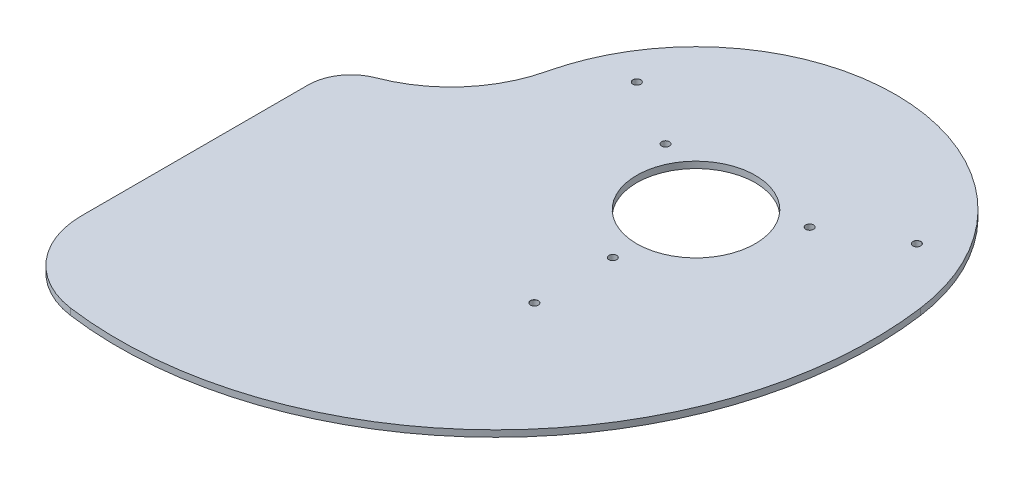
ISO-10303-21;
HEADER;
FILE_DESCRIPTION(('STEP AP214'),'2;1');
FILE_NAME('part.step','',(''),(''),'','','');
FILE_SCHEMA(('AUTOMOTIVE_DESIGN { 1 0 10303 214 1 1 1 1 }'));
ENDSEC;
DATA;
#1=APPLICATION_CONTEXT('core data for automotive mechanical design processes');
#2=APPLICATION_PROTOCOL_DEFINITION('international standard','automotive_design',2000,#1);
#3=PRODUCT_CONTEXT('',#1,'mechanical');
#4=PRODUCT('Part','Part','',(#3));
#5=PRODUCT_RELATED_PRODUCT_CATEGORY('part','',(#4));
#6=PRODUCT_DEFINITION_FORMATION('','',#4);
#7=PRODUCT_DEFINITION_CONTEXT('part definition',#1,'design');
#8=PRODUCT_DEFINITION('design','',#6,#7);
#9=PRODUCT_DEFINITION_SHAPE('','',#8);
#10=(LENGTH_UNIT() NAMED_UNIT(*) SI_UNIT(.MILLI.,.METRE.));
#11=(NAMED_UNIT(*) PLANE_ANGLE_UNIT() SI_UNIT($,.RADIAN.));
#12=(NAMED_UNIT(*) SI_UNIT($,.STERADIAN.) SOLID_ANGLE_UNIT());
#13=UNCERTAINTY_MEASURE_WITH_UNIT(LENGTH_MEASURE(1.E-05),#10,'distance_accuracy_value','');
#14=(GEOMETRIC_REPRESENTATION_CONTEXT(3) GLOBAL_UNCERTAINTY_ASSIGNED_CONTEXT((#13)) GLOBAL_UNIT_ASSIGNED_CONTEXT((#10,
#11,#12)) REPRESENTATION_CONTEXT('',''));
#15=CARTESIAN_POINT('',(0.,0.,0.));
#16=DIRECTION('',(0.,0.,1.));
#17=DIRECTION('',(1.,0.,0.));
#18=AXIS2_PLACEMENT_3D('',#15,#16,#17);
#19=CARTESIAN_POINT('',(0.,35.,0.));
#20=DIRECTION('',(0.,-1.,0.));
#21=DIRECTION('',(0.,0.,-1.));
#22=AXIS2_PLACEMENT_3D('',#19,#20,#21);
#23=PLANE('',#22);
#24=CARTESIAN_POINT('',(-64.9519052838329,35.,-37.5));
#25=DIRECTION('',(0.,1.,0.));
#26=DIRECTION('',(0.,0.,1.));
#27=AXIS2_PLACEMENT_3D('',#24,#25,#26);
#28=CIRCLE('',#27,1.82500000000001);
#29=CARTESIAN_POINT('',(-64.9519052838329,35.,-35.675));
#30=VERTEX_POINT('',#29);
#31=EDGE_CURVE('E405',#30,#30,#28,.T.);
#32=ORIENTED_EDGE('',*,*,#31,.F.);
#33=EDGE_LOOP('',(#32));
#34=FACE_BOUND('',#33,.T.);
#35=CARTESIAN_POINT('',(64.9519052838329,35.,-37.5));
#36=DIRECTION('',(0.,1.,0.));
#37=DIRECTION('',(0.,0.,1.));
#38=AXIS2_PLACEMENT_3D('',#35,#36,#37);
#39=CIRCLE('',#38,1.82500000000001);
#40=CARTESIAN_POINT('',(64.9519052838329,35.,-35.675));
#41=VERTEX_POINT('',#40);
#42=EDGE_CURVE('E421',#41,#41,#39,.T.);
#43=ORIENTED_EDGE('',*,*,#42,.F.);
#44=EDGE_LOOP('',(#43));
#45=FACE_BOUND('',#44,.T.);
#46=CARTESIAN_POINT('',(0.,35.,0.));
#47=DIRECTION('',(0.,1.,0.));
#48=DIRECTION('',(0.,0.,1.));
#49=AXIS2_PLACEMENT_3D('',#46,#47,#48);
#50=CIRCLE('',#49,27.5);
#51=CARTESIAN_POINT('',(0.,35.,27.5));
#52=VERTEX_POINT('',#51);
#53=EDGE_CURVE('E163',#52,#52,#50,.T.);
#54=ORIENTED_EDGE('',*,*,#53,.F.);
#55=EDGE_LOOP('',(#54));
#56=FACE_BOUND('',#55,.T.);
#57=CARTESIAN_POINT('',(0.,35.,38.600000000005));
#58=DIRECTION('',(0.,-1.,0.));
#59=DIRECTION('',(0.,0.,-1.));
#60=AXIS2_PLACEMENT_3D('',#57,#58,#59);
#61=CIRCLE('',#60,1.8);
#62=CARTESIAN_POINT('',(0.,35.,36.800000000005));
#63=VERTEX_POINT('',#62);
#64=EDGE_CURVE('E160',#63,#63,#61,.T.);
#65=ORIENTED_EDGE('',*,*,#64,.T.);
#66=EDGE_LOOP('',(#65));
#67=FACE_BOUND('',#66,.T.);
#68=CARTESIAN_POINT('',(-33.4285805860836,35.,-19.3000000000027));
#69=DIRECTION('',(0.,-1.,0.));
#70=DIRECTION('',(0.,0.,-1.));
#71=AXIS2_PLACEMENT_3D('',#68,#69,#70);
#72=CIRCLE('',#71,1.8);
#73=CARTESIAN_POINT('',(-33.4285805860836,35.,-21.1000000000027));
#74=VERTEX_POINT('',#73);
#75=EDGE_CURVE('E154',#74,#74,#72,.T.);
#76=ORIENTED_EDGE('',*,*,#75,.T.);
#77=EDGE_LOOP('',(#76));
#78=FACE_BOUND('',#77,.T.);
#79=CARTESIAN_POINT('',(33.4285805860838,35.,-19.3000000000022));
#80=DIRECTION('',(0.,-1.,0.));
#81=DIRECTION('',(0.,0.,-1.));
#82=AXIS2_PLACEMENT_3D('',#79,#80,#81);
#83=CIRCLE('',#82,1.8);
#84=CARTESIAN_POINT('',(33.4285805860838,35.,-21.1000000000022));
#85=VERTEX_POINT('',#84);
#86=EDGE_CURVE('E148',#85,#85,#83,.T.);
#87=ORIENTED_EDGE('',*,*,#86,.T.);
#88=EDGE_LOOP('',(#87));
#89=FACE_BOUND('',#88,.T.);
#90=CARTESIAN_POINT('',(-120.,35.,40.));
#91=DIRECTION('',(0.,1.,0.));
#92=DIRECTION('',(0.,0.,1.));
#93=AXIS2_PLACEMENT_3D('',#90,#91,#92);
#94=CIRCLE('',#93,20.);
#95=CARTESIAN_POINT('',(-140.,35.,40.));
#96=VERTEX_POINT('',#95);
#97=CARTESIAN_POINT('',(-127.121626837055,35.,21.3109007388336));
#98=VERTEX_POINT('',#97);
#99=EDGE_CURVE('E101',#96,#98,#94,.F.);
#100=ORIENTED_EDGE('',*,*,#99,.F.);
#101=DIRECTION('',(0.,0.,1.));
#102=VECTOR('',#101,1.);
#103=CARTESIAN_POINT('',(-140.,35.,0.));
#104=LINE('',#103,#102);
#105=CARTESIAN_POINT('',(-140.,35.,145.));
#106=VERTEX_POINT('',#105);
#107=EDGE_CURVE('E132',#96,#106,#104,.T.);
#108=ORIENTED_EDGE('',*,*,#107,.T.);
#109=CARTESIAN_POINT('',(-100.,35.,145.));
#110=DIRECTION('',(0.,1.,0.));
#111=DIRECTION('',(0.,0.,1.));
#112=AXIS2_PLACEMENT_3D('',#109,#110,#111);
#113=CIRCLE('',#112,40.);
#114=CARTESIAN_POINT('',(-105.413194934563,35.,184.632023927632));
#115=VERTEX_POINT('',#114);
#116=EDGE_CURVE('E62',#106,#115,#113,.T.);
#117=ORIENTED_EDGE('',*,*,#116,.T.);
#118=CARTESIAN_POINT('',(-81.7304670958509,35.,11.2419192442408));
#119=DIRECTION('',(0.,1.,0.));
#120=DIRECTION('',(0.,0.,1.));
#121=AXIS2_PLACEMENT_3D('',#118,#119,#120);
#122=CIRCLE('',#121,175.);
#123=CARTESIAN_POINT('',(91.6371903801965,35.,-12.6045761223306));
#124=VERTEX_POINT('',#123);
#125=EDGE_CURVE('E125',#115,#124,#122,.T.);
#126=ORIENTED_EDGE('',*,*,#125,.T.);
#127=CARTESIAN_POINT('',(0.,35.,0.));
#128=DIRECTION('',(0.,1.,0.));
#129=DIRECTION('',(0.,0.,1.));
#130=AXIS2_PLACEMENT_3D('',#127,#128,#129);
#131=CIRCLE('',#130,92.5);
#132=CARTESIAN_POINT('',(-90.0655864243313,35.,-21.0817490270923));
#133=VERTEX_POINT('',#132);
#134=EDGE_CURVE('E123',#124,#133,#131,.T.);
#135=ORIENTED_EDGE('',*,*,#134,.T.);
#136=CARTESIAN_POINT('',(-148.486507348222,35.,-34.7563970446657));
#137=DIRECTION('',(0.,1.,0.));
#138=DIRECTION('',(0.,0.,1.));
#139=AXIS2_PLACEMENT_3D('',#136,#137,#138);
#140=CIRCLE('',#139,60.);
#141=EDGE_CURVE('E108',#98,#133,#140,.T.);
#142=ORIENTED_EDGE('',*,*,#141,.F.);
#143=EDGE_LOOP('',(#100,#108,#117,#126,#135,#142));
#144=FACE_BOUND('',#143,.T.);
#145=CARTESIAN_POINT('',(0.,35.,75.0000000000001));
#146=DIRECTION('',(0.,1.,0.));
#147=DIRECTION('',(0.,0.,1.));
#148=AXIS2_PLACEMENT_3D('',#145,#146,#147);
#149=CIRCLE('',#148,1.825);
#150=CARTESIAN_POINT('',(0.,35.,76.8250000000001));
#151=VERTEX_POINT('',#150);
#152=EDGE_CURVE('E412',#151,#151,#149,.T.);
#153=ORIENTED_EDGE('',*,*,#152,.F.);
#154=EDGE_LOOP('',(#153));
#155=FACE_BOUND('',#154,.T.);
#156=ADVANCED_FACE('F45',(#34,#45,#56,#67,#78,#89,#144,#155),#23,.F.);
#157=CARTESIAN_POINT('',(0.,32.,0.));
#158=DIRECTION('',(0.,-1.,0.));
#159=DIRECTION('',(0.,0.,-1.));
#160=AXIS2_PLACEMENT_3D('',#157,#158,#159);
#161=PLANE('',#160);
#162=CARTESIAN_POINT('',(-64.9519052838329,32.,-37.5));
#163=DIRECTION('',(0.,1.,0.));
#164=DIRECTION('',(0.,0.,1.));
#165=AXIS2_PLACEMENT_3D('',#162,#163,#164);
#166=CIRCLE('',#165,1.79999999999998);
#167=CARTESIAN_POINT('',(-64.9519052838329,32.,-35.7));
#168=VERTEX_POINT('',#167);
#169=EDGE_CURVE('E407',#168,#168,#166,.T.);
#170=ORIENTED_EDGE('',*,*,#169,.T.);
#171=EDGE_LOOP('',(#170));
#172=FACE_BOUND('',#171,.T.);
#173=CARTESIAN_POINT('',(0.,32.,75.0000000000001));
#174=DIRECTION('',(0.,1.,0.));
#175=DIRECTION('',(0.,0.,1.));
#176=AXIS2_PLACEMENT_3D('',#173,#174,#175);
#177=CIRCLE('',#176,1.79999999999999);
#178=CARTESIAN_POINT('',(0.,32.,76.8));
#179=VERTEX_POINT('',#178);
#180=EDGE_CURVE('E418',#179,#179,#177,.T.);
#181=ORIENTED_EDGE('',*,*,#180,.T.);
#182=EDGE_LOOP('',(#181));
#183=FACE_BOUND('',#182,.T.);
#184=CARTESIAN_POINT('',(64.9519052838329,32.,-37.5));
#185=DIRECTION('',(0.,1.,0.));
#186=DIRECTION('',(0.,0.,1.));
#187=AXIS2_PLACEMENT_3D('',#184,#185,#186);
#188=CIRCLE('',#187,1.79999999999998);
#189=CARTESIAN_POINT('',(64.9519052838329,32.,-35.7));
#190=VERTEX_POINT('',#189);
#191=EDGE_CURVE('E109',#190,#190,#188,.T.);
#192=ORIENTED_EDGE('',*,*,#191,.T.);
#193=EDGE_LOOP('',(#192));
#194=FACE_BOUND('',#193,.T.);
#195=CARTESIAN_POINT('',(0.,32.,0.));
#196=DIRECTION('',(0.,-1.,0.));
#197=DIRECTION('',(0.,0.,-1.));
#198=AXIS2_PLACEMENT_3D('',#195,#196,#197);
#199=CIRCLE('',#198,27.5);
#200=CARTESIAN_POINT('',(0.,32.,-27.5));
#201=VERTEX_POINT('',#200);
#202=EDGE_CURVE('E166',#201,#201,#199,.T.);
#203=ORIENTED_EDGE('',*,*,#202,.F.);
#204=EDGE_LOOP('',(#203));
#205=FACE_BOUND('',#204,.T.);
#206=CARTESIAN_POINT('',(0.,32.,38.600000000005));
#207=DIRECTION('',(0.,-1.,0.));
#208=DIRECTION('',(0.,0.,-1.));
#209=AXIS2_PLACEMENT_3D('',#206,#207,#208);
#210=CIRCLE('',#209,1.79999999999999);
#211=CARTESIAN_POINT('',(0.,32.,36.800000000005));
#212=VERTEX_POINT('',#211);
#213=EDGE_CURVE('E157',#212,#212,#210,.T.);
#214=ORIENTED_EDGE('',*,*,#213,.F.);
#215=EDGE_LOOP('',(#214));
#216=FACE_BOUND('',#215,.T.);
#217=CARTESIAN_POINT('',(-33.4285805860836,32.,-19.3000000000027));
#218=DIRECTION('',(0.,-1.,0.));
#219=DIRECTION('',(0.,0.,-1.));
#220=AXIS2_PLACEMENT_3D('',#217,#218,#219);
#221=CIRCLE('',#220,1.79999999999999);
#222=CARTESIAN_POINT('',(-33.4285805860836,32.,-21.1000000000026));
#223=VERTEX_POINT('',#222);
#224=EDGE_CURVE('E151',#223,#223,#221,.T.);
#225=ORIENTED_EDGE('',*,*,#224,.F.);
#226=EDGE_LOOP('',(#225));
#227=FACE_BOUND('',#226,.T.);
#228=CARTESIAN_POINT('',(33.4285805860838,32.,-19.3000000000022));
#229=DIRECTION('',(0.,-1.,0.));
#230=DIRECTION('',(0.,0.,-1.));
#231=AXIS2_PLACEMENT_3D('',#228,#229,#230);
#232=CIRCLE('',#231,1.79999999999999);
#233=CARTESIAN_POINT('',(33.4285805860838,32.,-21.1000000000022));
#234=VERTEX_POINT('',#233);
#235=EDGE_CURVE('E116',#234,#234,#232,.T.);
#236=ORIENTED_EDGE('',*,*,#235,.F.);
#237=EDGE_LOOP('',(#236));
#238=FACE_BOUND('',#237,.T.);
#239=DIRECTION('',(0.,0.,1.));
#240=VECTOR('',#239,1.);
#241=CARTESIAN_POINT('',(-140.,32.,0.));
#242=LINE('',#241,#240);
#243=CARTESIAN_POINT('',(-140.,32.,40.));
#244=VERTEX_POINT('',#243);
#245=CARTESIAN_POINT('',(-140.,32.,145.));
#246=VERTEX_POINT('',#245);
#247=EDGE_CURVE('E169',#244,#246,#242,.T.);
#248=ORIENTED_EDGE('',*,*,#247,.F.);
#249=CARTESIAN_POINT('',(-120.,32.,40.));
#250=DIRECTION('',(0.,-1.,0.));
#251=DIRECTION('',(0.,0.,-1.));
#252=AXIS2_PLACEMENT_3D('',#249,#250,#251);
#253=CIRCLE('',#252,20.);
#254=CARTESIAN_POINT('',(-127.121626837055,32.,21.3109007388336));
#255=VERTEX_POINT('',#254);
#256=EDGE_CURVE('E11',#244,#255,#253,.T.);
#257=ORIENTED_EDGE('',*,*,#256,.T.);
#258=CARTESIAN_POINT('',(-148.486507348222,32.,-34.7563970446657));
#259=DIRECTION('',(0.,-1.,0.));
#260=DIRECTION('',(0.,0.,-1.));
#261=AXIS2_PLACEMENT_3D('',#258,#259,#260);
#262=CIRCLE('',#261,60.);
#263=CARTESIAN_POINT('',(-90.0655864243313,32.,-21.0817490270923));
#264=VERTEX_POINT('',#263);
#265=EDGE_CURVE('E53',#255,#264,#262,.F.);
#266=ORIENTED_EDGE('',*,*,#265,.T.);
#267=CARTESIAN_POINT('',(0.,32.,0.));
#268=DIRECTION('',(0.,-1.,0.));
#269=DIRECTION('',(0.,0.,-1.));
#270=AXIS2_PLACEMENT_3D('',#267,#268,#269);
#271=CIRCLE('',#270,92.5);
#272=CARTESIAN_POINT('',(91.6371903801965,32.,-12.6045761223306));
#273=VERTEX_POINT('',#272);
#274=EDGE_CURVE('E177',#273,#264,#271,.F.);
#275=ORIENTED_EDGE('',*,*,#274,.F.);
#276=CARTESIAN_POINT('',(-81.7304670958509,32.,11.2419192442408));
#277=DIRECTION('',(0.,-1.,0.));
#278=DIRECTION('',(0.,0.,-1.));
#279=AXIS2_PLACEMENT_3D('',#276,#277,#278);
#280=CIRCLE('',#279,175.);
#281=CARTESIAN_POINT('',(-105.413194934563,32.,184.632023927632));
#282=VERTEX_POINT('',#281);
#283=EDGE_CURVE('E175',#282,#273,#280,.F.);
#284=ORIENTED_EDGE('',*,*,#283,.F.);
#285=CARTESIAN_POINT('',(-100.,32.,145.));
#286=DIRECTION('',(0.,-1.,0.));
#287=DIRECTION('',(0.,0.,-1.));
#288=AXIS2_PLACEMENT_3D('',#285,#286,#287);
#289=CIRCLE('',#288,40.);
#290=EDGE_CURVE('E172',#246,#282,#289,.F.);
#291=ORIENTED_EDGE('',*,*,#290,.F.);
#292=EDGE_LOOP('',(#248,#257,#266,#275,#284,#291));
#293=FACE_BOUND('',#292,.T.);
#294=ADVANCED_FACE('F47',(#172,#183,#194,#205,#216,#227,#238,#293),#161,.T.);
#295=CARTESIAN_POINT('',(0.,35.,0.));
#296=DIRECTION('',(0.,1.,0.));
#297=DIRECTION('',(0.,0.,1.));
#298=AXIS2_PLACEMENT_3D('',#295,#296,#297);
#299=CYLINDRICAL_SURFACE('',#298,27.5);
#300=ORIENTED_EDGE('',*,*,#202,.T.);
#301=EDGE_LOOP('',(#300));
#302=FACE_BOUND('',#301,.T.);
#303=ORIENTED_EDGE('',*,*,#53,.T.);
#304=EDGE_LOOP('',(#303));
#305=FACE_BOUND('',#304,.T.);
#306=ADVANCED_FACE('F203',(#302,#305),#299,.F.);
#307=CARTESIAN_POINT('',(0.,32.,38.600000000005));
#308=DIRECTION('',(0.,-1.,0.));
#309=DIRECTION('',(0.,0.,-1.));
#310=AXIS2_PLACEMENT_3D('',#307,#308,#309);
#311=CYLINDRICAL_SURFACE('',#310,1.79999999999999);
#312=ORIENTED_EDGE('',*,*,#64,.F.);
#313=EDGE_LOOP('',(#312));
#314=FACE_BOUND('',#313,.T.);
#315=ORIENTED_EDGE('',*,*,#213,.T.);
#316=EDGE_LOOP('',(#315));
#317=FACE_BOUND('',#316,.T.);
#318=ADVANCED_FACE('F210',(#314,#317),#311,.F.);
#319=CARTESIAN_POINT('',(-33.4285805860836,32.,-19.3000000000027));
#320=DIRECTION('',(0.,-1.,0.));
#321=DIRECTION('',(0.,0.,-1.));
#322=AXIS2_PLACEMENT_3D('',#319,#320,#321);
#323=CYLINDRICAL_SURFACE('',#322,1.79999999999999);
#324=ORIENTED_EDGE('',*,*,#75,.F.);
#325=EDGE_LOOP('',(#324));
#326=FACE_BOUND('',#325,.T.);
#327=ORIENTED_EDGE('',*,*,#224,.T.);
#328=EDGE_LOOP('',(#327));
#329=FACE_BOUND('',#328,.T.);
#330=ADVANCED_FACE('F214',(#326,#329),#323,.F.);
#331=CARTESIAN_POINT('',(33.4285805860838,32.,-19.3000000000022));
#332=DIRECTION('',(0.,-1.,0.));
#333=DIRECTION('',(0.,0.,-1.));
#334=AXIS2_PLACEMENT_3D('',#331,#332,#333);
#335=CYLINDRICAL_SURFACE('',#334,1.79999999999999);
#336=ORIENTED_EDGE('',*,*,#86,.F.);
#337=EDGE_LOOP('',(#336));
#338=FACE_BOUND('',#337,.T.);
#339=ORIENTED_EDGE('',*,*,#235,.T.);
#340=EDGE_LOOP('',(#339));
#341=FACE_BOUND('',#340,.T.);
#342=ADVANCED_FACE('F218',(#338,#341),#335,.F.);
#343=CARTESIAN_POINT('',(-120.,35.,40.));
#344=DIRECTION('',(0.,-1.,0.));
#345=DIRECTION('',(0.,0.,-1.));
#346=AXIS2_PLACEMENT_3D('',#343,#344,#345);
#347=CYLINDRICAL_SURFACE('',#346,20.);
#348=DIRECTION('',(0.,-1.,0.));
#349=VECTOR('',#348,1.);
#350=CARTESIAN_POINT('',(-140.,35.,40.));
#351=LINE('',#350,#349);
#352=EDGE_CURVE('E70',#96,#244,#351,.T.);
#353=ORIENTED_EDGE('',*,*,#352,.F.);
#354=ORIENTED_EDGE('',*,*,#99,.T.);
#355=DIRECTION('',(0.,-1.,0.));
#356=VECTOR('',#355,1.);
#357=CARTESIAN_POINT('',(-127.121626837055,35.,21.3109007388336));
#358=LINE('',#357,#356);
#359=EDGE_CURVE('E104',#98,#255,#358,.T.);
#360=ORIENTED_EDGE('',*,*,#359,.T.);
#361=ORIENTED_EDGE('',*,*,#256,.F.);
#362=EDGE_LOOP('',(#353,#354,#360,#361));
#363=FACE_BOUND('',#362,.T.);
#364=ADVANCED_FACE('F103',(#363),#347,.T.);
#365=CARTESIAN_POINT('',(-148.486507348222,35.,-34.7563970446657));
#366=DIRECTION('',(0.,-1.,0.));
#367=DIRECTION('',(0.,0.,-1.));
#368=AXIS2_PLACEMENT_3D('',#365,#366,#367);
#369=CYLINDRICAL_SURFACE('',#368,60.);
#370=ORIENTED_EDGE('',*,*,#359,.F.);
#371=ORIENTED_EDGE('',*,*,#141,.T.);
#372=DIRECTION('',(0.,-1.,0.));
#373=VECTOR('',#372,1.);
#374=CARTESIAN_POINT('',(-90.0655864243313,35.,-21.0817490270923));
#375=LINE('',#374,#373);
#376=EDGE_CURVE('E117',#133,#264,#375,.T.);
#377=ORIENTED_EDGE('',*,*,#376,.T.);
#378=ORIENTED_EDGE('',*,*,#265,.F.);
#379=EDGE_LOOP('',(#370,#371,#377,#378));
#380=FACE_BOUND('',#379,.T.);
#381=ADVANCED_FACE('F112',(#380),#369,.F.);
#382=CARTESIAN_POINT('',(0.,35.,0.));
#383=DIRECTION('',(0.,-1.,0.));
#384=DIRECTION('',(0.,0.,-1.));
#385=AXIS2_PLACEMENT_3D('',#382,#383,#384);
#386=CYLINDRICAL_SURFACE('',#385,92.5);
#387=ORIENTED_EDGE('',*,*,#274,.T.);
#388=ORIENTED_EDGE('',*,*,#376,.F.);
#389=ORIENTED_EDGE('',*,*,#134,.F.);
#390=DIRECTION('',(0.,-1.,0.));
#391=VECTOR('',#390,1.);
#392=CARTESIAN_POINT('',(91.6371903801965,35.,-12.6045761223306));
#393=LINE('',#392,#391);
#394=EDGE_CURVE('E142',#124,#273,#393,.T.);
#395=ORIENTED_EDGE('',*,*,#394,.T.);
#396=EDGE_LOOP('',(#387,#388,#389,#395));
#397=FACE_BOUND('',#396,.T.);
#398=ADVANCED_FACE('F189',(#397),#386,.T.);
#399=CARTESIAN_POINT('',(-81.7304670958509,35.,11.2419192442408));
#400=DIRECTION('',(0.,-1.,0.));
#401=DIRECTION('',(0.,0.,-1.));
#402=AXIS2_PLACEMENT_3D('',#399,#400,#401);
#403=CYLINDRICAL_SURFACE('',#402,175.);
#404=ORIENTED_EDGE('',*,*,#283,.T.);
#405=ORIENTED_EDGE('',*,*,#394,.F.);
#406=ORIENTED_EDGE('',*,*,#125,.F.);
#407=DIRECTION('',(0.,-1.,0.));
#408=VECTOR('',#407,1.);
#409=CARTESIAN_POINT('',(-105.413194934563,35.,184.632023927632));
#410=LINE('',#409,#408);
#411=EDGE_CURVE('E139',#115,#282,#410,.T.);
#412=ORIENTED_EDGE('',*,*,#411,.T.);
#413=EDGE_LOOP('',(#404,#405,#406,#412));
#414=FACE_BOUND('',#413,.T.);
#415=ADVANCED_FACE('F187',(#414),#403,.T.);
#416=CARTESIAN_POINT('',(-100.,35.,145.));
#417=DIRECTION('',(0.,-1.,0.));
#418=DIRECTION('',(0.,0.,-1.));
#419=AXIS2_PLACEMENT_3D('',#416,#417,#418);
#420=CYLINDRICAL_SURFACE('',#419,40.);
#421=ORIENTED_EDGE('',*,*,#290,.T.);
#422=ORIENTED_EDGE('',*,*,#411,.F.);
#423=ORIENTED_EDGE('',*,*,#116,.F.);
#424=DIRECTION('',(0.,-1.,0.));
#425=VECTOR('',#424,1.);
#426=CARTESIAN_POINT('',(-140.,35.,145.));
#427=LINE('',#426,#425);
#428=EDGE_CURVE('E136',#106,#246,#427,.T.);
#429=ORIENTED_EDGE('',*,*,#428,.T.);
#430=EDGE_LOOP('',(#421,#422,#423,#429));
#431=FACE_BOUND('',#430,.T.);
#432=ADVANCED_FACE('F184',(#431),#420,.T.);
#433=CARTESIAN_POINT('',(-140.,35.,0.));
#434=DIRECTION('',(1.,0.,0.));
#435=DIRECTION('',(0.,0.,-1.));
#436=AXIS2_PLACEMENT_3D('',#433,#434,#435);
#437=PLANE('',#436);
#438=ORIENTED_EDGE('',*,*,#247,.T.);
#439=ORIENTED_EDGE('',*,*,#428,.F.);
#440=ORIENTED_EDGE('',*,*,#107,.F.);
#441=ORIENTED_EDGE('',*,*,#352,.T.);
#442=EDGE_LOOP('',(#438,#439,#440,#441));
#443=FACE_BOUND('',#442,.T.);
#444=ADVANCED_FACE('F183',(#443),#437,.F.);
#445=CARTESIAN_POINT('',(64.9519052838329,35.,-37.5));
#446=DIRECTION('',(0.,1.,0.));
#447=DIRECTION('',(0.,0.,1.));
#448=AXIS2_PLACEMENT_3D('',#445,#446,#447);
#449=CYLINDRICAL_SURFACE('',#448,1.79999999999998);
#450=ORIENTED_EDGE('',*,*,#191,.F.);
#451=EDGE_LOOP('',(#450));
#452=FACE_BOUND('',#451,.T.);
#453=CARTESIAN_POINT('',(64.9519052838329,34.975,-37.5));
#454=DIRECTION('',(0.,1.,0.));
#455=DIRECTION('',(0.,0.,1.));
#456=AXIS2_PLACEMENT_3D('',#453,#454,#455);
#457=CIRCLE('',#456,1.79999999999998);
#458=CARTESIAN_POINT('',(64.9519052838329,34.975,-35.7));
#459=VERTEX_POINT('',#458);
#460=EDGE_CURVE('E424',#459,#459,#457,.T.);
#461=ORIENTED_EDGE('',*,*,#460,.T.);
#462=EDGE_LOOP('',(#461));
#463=FACE_BOUND('',#462,.T.);
#464=ADVANCED_FACE('F265',(#452,#463),#449,.F.);
#465=CARTESIAN_POINT('',(64.9519052838329,35.,-37.5));
#466=DIRECTION('',(0.,1.,0.));
#467=DIRECTION('',(0.,0.,1.));
#468=AXIS2_PLACEMENT_3D('',#465,#466,#467);
#469=CONICAL_SURFACE('',#468,1.82500000000001,0.785398163398003);
#470=ORIENTED_EDGE('',*,*,#460,.F.);
#471=EDGE_LOOP('',(#470));
#472=FACE_BOUND('',#471,.T.);
#473=ORIENTED_EDGE('',*,*,#42,.T.);
#474=EDGE_LOOP('',(#473));
#475=FACE_BOUND('',#474,.T.);
#476=ADVANCED_FACE('F288',(#472,#475),#469,.F.);
#477=CARTESIAN_POINT('',(0.,35.,75.0000000000001));
#478=DIRECTION('',(0.,1.,0.));
#479=DIRECTION('',(0.,0.,1.));
#480=AXIS2_PLACEMENT_3D('',#477,#478,#479);
#481=CYLINDRICAL_SURFACE('',#480,1.79999999999999);
#482=ORIENTED_EDGE('',*,*,#180,.F.);
#483=EDGE_LOOP('',(#482));
#484=FACE_BOUND('',#483,.T.);
#485=CARTESIAN_POINT('',(0.,34.975,75.0000000000001));
#486=DIRECTION('',(0.,1.,0.));
#487=DIRECTION('',(0.,0.,1.));
#488=AXIS2_PLACEMENT_3D('',#485,#486,#487);
#489=CIRCLE('',#488,1.79999999999999);
#490=CARTESIAN_POINT('',(0.,34.975,76.8));
#491=VERTEX_POINT('',#490);
#492=EDGE_CURVE('E415',#491,#491,#489,.T.);
#493=ORIENTED_EDGE('',*,*,#492,.T.);
#494=EDGE_LOOP('',(#493));
#495=FACE_BOUND('',#494,.T.);
#496=ADVANCED_FACE('F299',(#484,#495),#481,.F.);
#497=CARTESIAN_POINT('',(0.,35.,75.0000000000001));
#498=DIRECTION('',(0.,1.,0.));
#499=DIRECTION('',(0.,0.,1.));
#500=AXIS2_PLACEMENT_3D('',#497,#498,#499);
#501=CONICAL_SURFACE('',#500,1.825,0.78539816339776);
#502=ORIENTED_EDGE('',*,*,#492,.F.);
#503=EDGE_LOOP('',(#502));
#504=FACE_BOUND('',#503,.T.);
#505=ORIENTED_EDGE('',*,*,#152,.T.);
#506=EDGE_LOOP('',(#505));
#507=FACE_BOUND('',#506,.T.);
#508=ADVANCED_FACE('F310',(#504,#507),#501,.F.);
#509=CARTESIAN_POINT('',(-64.9519052838329,35.,-37.5));
#510=DIRECTION('',(0.,1.,0.));
#511=DIRECTION('',(0.,0.,1.));
#512=AXIS2_PLACEMENT_3D('',#509,#510,#511);
#513=CYLINDRICAL_SURFACE('',#512,1.79999999999998);
#514=ORIENTED_EDGE('',*,*,#169,.F.);
#515=EDGE_LOOP('',(#514));
#516=FACE_BOUND('',#515,.T.);
#517=CARTESIAN_POINT('',(-64.9519052838329,34.975,-37.5));
#518=DIRECTION('',(0.,1.,0.));
#519=DIRECTION('',(0.,0.,1.));
#520=AXIS2_PLACEMENT_3D('',#517,#518,#519);
#521=CIRCLE('',#520,1.79999999999998);
#522=CARTESIAN_POINT('',(-64.9519052838329,34.975,-35.7));
#523=VERTEX_POINT('',#522);
#524=EDGE_CURVE('E403',#523,#523,#521,.T.);
#525=ORIENTED_EDGE('',*,*,#524,.T.);
#526=EDGE_LOOP('',(#525));
#527=FACE_BOUND('',#526,.T.);
#528=ADVANCED_FACE('F321',(#516,#527),#513,.F.);
#529=CARTESIAN_POINT('',(-64.9519052838329,35.,-37.5));
#530=DIRECTION('',(0.,1.,0.));
#531=DIRECTION('',(0.,0.,1.));
#532=AXIS2_PLACEMENT_3D('',#529,#530,#531);
#533=CONICAL_SURFACE('',#532,1.82500000000001,0.785398163398003);
#534=ORIENTED_EDGE('',*,*,#524,.F.);
#535=EDGE_LOOP('',(#534));
#536=FACE_BOUND('',#535,.T.);
#537=ORIENTED_EDGE('',*,*,#31,.T.);
#538=EDGE_LOOP('',(#537));
#539=FACE_BOUND('',#538,.T.);
#540=ADVANCED_FACE('F332',(#536,#539),#533,.F.);
#541=CLOSED_SHELL('',(#156,#294,#306,#318,#330,#342,#364,#381,#398,#415,#432,#444,#464,#476,
#496,#508,#528,#540));
#542=MANIFOLD_SOLID_BREP('B2',#541);
#543=ADVANCED_BREP_SHAPE_REPRESENTATION('',(#18,#542),#14);
#544=SHAPE_DEFINITION_REPRESENTATION(#9,#543);
ENDSEC;
END-ISO-10303-21;
